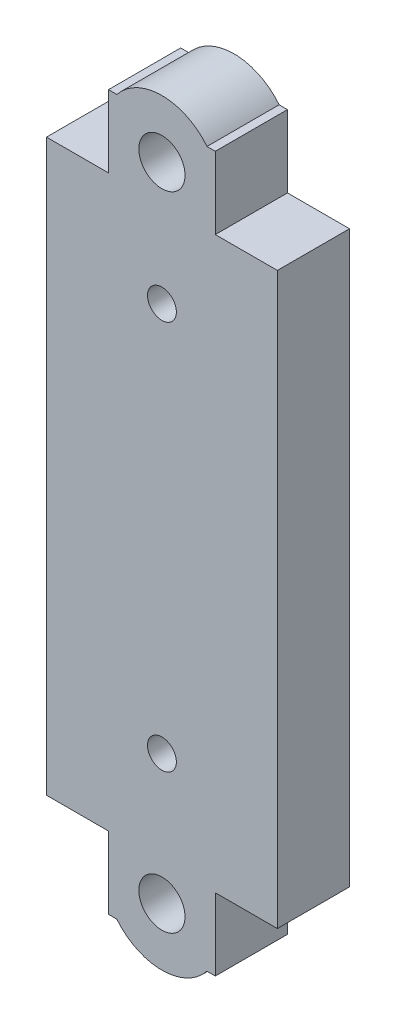
ISO-10303-21;
HEADER;
FILE_DESCRIPTION(('STEP AP214'),'2;1');
FILE_NAME('part.step','',(''),(''),'','','');
FILE_SCHEMA(('AUTOMOTIVE_DESIGN { 1 0 10303 214 1 1 1 1 }'));
ENDSEC;
DATA;
#1=APPLICATION_CONTEXT('core data for automotive mechanical design processes');
#2=APPLICATION_PROTOCOL_DEFINITION('international standard','automotive_design',2000,#1);
#3=PRODUCT_CONTEXT('',#1,'mechanical');
#4=PRODUCT('Part','Part','',(#3));
#5=PRODUCT_RELATED_PRODUCT_CATEGORY('part','',(#4));
#6=PRODUCT_DEFINITION_FORMATION('','',#4);
#7=PRODUCT_DEFINITION_CONTEXT('part definition',#1,'design');
#8=PRODUCT_DEFINITION('design','',#6,#7);
#9=PRODUCT_DEFINITION_SHAPE('','',#8);
#10=(LENGTH_UNIT() NAMED_UNIT(*) SI_UNIT(.MILLI.,.METRE.));
#11=(NAMED_UNIT(*) PLANE_ANGLE_UNIT() SI_UNIT($,.RADIAN.));
#12=(NAMED_UNIT(*) SI_UNIT($,.STERADIAN.) SOLID_ANGLE_UNIT());
#13=UNCERTAINTY_MEASURE_WITH_UNIT(LENGTH_MEASURE(1.E-05),#10,'distance_accuracy_value','');
#14=(GEOMETRIC_REPRESENTATION_CONTEXT(3) GLOBAL_UNCERTAINTY_ASSIGNED_CONTEXT((#13)) GLOBAL_UNIT_ASSIGNED_CONTEXT((#10,
#11,#12)) REPRESENTATION_CONTEXT('',''));
#15=CARTESIAN_POINT('',(0.,0.,0.));
#16=DIRECTION('',(0.,0.,1.));
#17=DIRECTION('',(1.,0.,0.));
#18=AXIS2_PLACEMENT_3D('',#15,#16,#17);
#19=CARTESIAN_POINT('',(1.01197788697789,11.6590909090909,-5.));
#20=DIRECTION('',(0.,1.,0.));
#21=DIRECTION('',(0.,0.,1.));
#22=AXIS2_PLACEMENT_3D('',#19,#20,#21);
#23=PLANE('',#22);
#24=DIRECTION('',(0.,0.,1.));
#25=VECTOR('',#24,1.);
#26=CARTESIAN_POINT('',(-10.6880221130236,11.6590909090909,-5.));
#27=LINE('',#26,#25);
#28=CARTESIAN_POINT('',(-10.6880221130236,11.6590909090909,0.));
#29=VERTEX_POINT('',#28);
#30=CARTESIAN_POINT('',(-10.6880221130236,11.6590909090909,5.));
#31=VERTEX_POINT('',#30);
#32=EDGE_CURVE('E166',#29,#31,#27,.T.);
#33=ORIENTED_EDGE('',*,*,#32,.T.);
#34=DIRECTION('',(-1.,0.,0.));
#35=VECTOR('',#34,1.);
#36=CARTESIAN_POINT('',(1.01197788697789,11.6590909090909,5.));
#37=LINE('',#36,#35);
#38=CARTESIAN_POINT('',(-10.1105211122259,11.6590909090909,5.));
#39=VERTEX_POINT('',#38);
#40=EDGE_CURVE('E171',#39,#31,#37,.T.);
#41=ORIENTED_EDGE('',*,*,#40,.F.);
#42=DIRECTION('',(0.,0.,1.));
#43=VECTOR('',#42,1.);
#44=CARTESIAN_POINT('',(-10.1105211122259,11.6590909090909,0.));
#45=LINE('',#44,#43);
#46=CARTESIAN_POINT('',(-10.1105211122259,11.6590909090909,0.));
#47=VERTEX_POINT('',#46);
#48=EDGE_CURVE('E211',#47,#39,#45,.T.);
#49=ORIENTED_EDGE('',*,*,#48,.F.);
#50=DIRECTION('',(-1.,0.,0.));
#51=VECTOR('',#50,1.);
#52=CARTESIAN_POINT('',(0.,11.6590909090909,0.));
#53=LINE('',#52,#51);
#54=EDGE_CURVE('E239',#47,#29,#53,.T.);
#55=ORIENTED_EDGE('',*,*,#54,.T.);
#56=EDGE_LOOP('',(#33,#41,#49,#55));
#57=FACE_BOUND('',#56,.T.);
#58=ADVANCED_FACE('F36',(#57),#23,.T.);
#59=CARTESIAN_POINT('',(1.01197788697789,-37.8409090909091,-5.));
#60=DIRECTION('',(0.,-1.,0.));
#61=DIRECTION('',(0.,0.,-1.));
#62=AXIS2_PLACEMENT_3D('',#59,#60,#61);
#63=PLANE('',#62);
#64=DIRECTION('',(0.,0.,1.));
#65=VECTOR('',#64,1.);
#66=CARTESIAN_POINT('',(-3.28802211302445,-37.84090909091,-5.));
#67=LINE('',#66,#65);
#68=CARTESIAN_POINT('',(-3.28802211302445,-37.84090909091,0.));
#69=VERTEX_POINT('',#68);
#70=CARTESIAN_POINT('',(-3.28802211302445,-37.84090909091,5.));
#71=VERTEX_POINT('',#70);
#72=EDGE_CURVE('E194',#69,#71,#67,.T.);
#73=ORIENTED_EDGE('',*,*,#72,.T.);
#74=DIRECTION('',(1.,0.,0.));
#75=VECTOR('',#74,1.);
#76=CARTESIAN_POINT('',(1.01197788697789,-37.8409090909091,5.));
#77=LINE('',#76,#75);
#78=CARTESIAN_POINT('',(-3.86552311382832,-37.8409090909091,5.));
#79=VERTEX_POINT('',#78);
#80=EDGE_CURVE('E236',#79,#71,#77,.T.);
#81=ORIENTED_EDGE('',*,*,#80,.F.);
#82=DIRECTION('',(0.,0.,1.));
#83=VECTOR('',#82,1.);
#84=CARTESIAN_POINT('',(-3.86552311382832,-37.8409090909091,0.));
#85=LINE('',#84,#83);
#86=CARTESIAN_POINT('',(-3.86552311382832,-37.8409090909091,0.));
#87=VERTEX_POINT('',#86);
#88=EDGE_CURVE('E219',#87,#79,#85,.T.);
#89=ORIENTED_EDGE('',*,*,#88,.F.);
#90=DIRECTION('',(1.,0.,0.));
#91=VECTOR('',#90,1.);
#92=CARTESIAN_POINT('',(0.,-37.8409090909091,0.));
#93=LINE('',#92,#91);
#94=EDGE_CURVE('E245',#87,#69,#93,.T.);
#95=ORIENTED_EDGE('',*,*,#94,.T.);
#96=EDGE_LOOP('',(#73,#81,#89,#95));
#97=FACE_BOUND('',#96,.T.);
#98=ADVANCED_FACE('F301',(#97),#63,.T.);
#99=CARTESIAN_POINT('',(0.,0.,5.));
#100=DIRECTION('',(0.,0.,1.));
#101=DIRECTION('',(1.,0.,0.));
#102=AXIS2_PLACEMENT_3D('',#99,#100,#101);
#103=PLANE('',#102);
#104=DIRECTION('',(-1.,0.,0.));
#105=VECTOR('',#104,1.);
#106=CARTESIAN_POINT('',(-9.98802211302211,-32.8409090909091,5.));
#107=LINE('',#106,#105);
#108=CARTESIAN_POINT('',(-10.6880221130244,-32.8409090909091,5.));
#109=VERTEX_POINT('',#108);
#110=CARTESIAN_POINT('',(-14.9880221130221,-32.8409090909091,5.));
#111=VERTEX_POINT('',#110);
#112=EDGE_CURVE('E254',#109,#111,#107,.T.);
#113=ORIENTED_EDGE('',*,*,#112,.F.);
#114=DIRECTION('',(0.,1.,0.));
#115=VECTOR('',#114,1.);
#116=CARTESIAN_POINT('',(-10.6880221130244,-37.84090909091,5.));
#117=LINE('',#116,#115);
#118=CARTESIAN_POINT('',(-10.6880221130244,-37.84090909091,5.));
#119=VERTEX_POINT('',#118);
#120=EDGE_CURVE('E176',#119,#109,#117,.T.);
#121=ORIENTED_EDGE('',*,*,#120,.F.);
#122=CARTESIAN_POINT('',(-10.1105211122275,-37.8409090909091,5.));
#123=VERTEX_POINT('',#122);
#124=EDGE_CURVE('E237',#119,#123,#77,.T.);
#125=ORIENTED_EDGE('',*,*,#124,.T.);
#126=CARTESIAN_POINT('',(-6.98802211302791,-35.3409090909095,5.));
#127=DIRECTION('',(0.,0.,1.));
#128=DIRECTION('',(1.,0.,0.));
#129=AXIS2_PLACEMENT_3D('',#126,#127,#128);
#130=CIRCLE('',#129,4.);
#131=EDGE_CURVE('E58',#123,#79,#130,.T.);
#132=ORIENTED_EDGE('',*,*,#131,.T.);
#133=ORIENTED_EDGE('',*,*,#80,.T.);
#134=DIRECTION('',(0.,-1.,0.));
#135=VECTOR('',#134,1.);
#136=CARTESIAN_POINT('',(-3.28802211302445,-37.84090909091,5.));
#137=LINE('',#136,#135);
#138=CARTESIAN_POINT('',(-3.28802211302445,-32.8409090909091,5.));
#139=VERTEX_POINT('',#138);
#140=EDGE_CURVE('E184',#139,#71,#137,.T.);
#141=ORIENTED_EDGE('',*,*,#140,.F.);
#142=DIRECTION('',(-1.,0.,0.));
#143=VECTOR('',#142,1.);
#144=CARTESIAN_POINT('',(-3.98802211302211,-32.8409090909091,5.));
#145=LINE('',#144,#143);
#146=CARTESIAN_POINT('',(1.01197788697789,-32.8409090909091,5.));
#147=VERTEX_POINT('',#146);
#148=EDGE_CURVE('E273',#147,#139,#145,.T.);
#149=ORIENTED_EDGE('',*,*,#148,.F.);
#150=DIRECTION('',(0.,1.,0.));
#151=VECTOR('',#150,1.);
#152=CARTESIAN_POINT('',(1.01197788697789,-37.8409090909091,5.));
#153=LINE('',#152,#151);
#154=CARTESIAN_POINT('',(1.01197788697789,6.65909090909093,5.));
#155=VERTEX_POINT('',#154);
#156=EDGE_CURVE('E228',#147,#155,#153,.T.);
#157=ORIENTED_EDGE('',*,*,#156,.T.);
#158=DIRECTION('',(1.,0.,0.));
#159=VECTOR('',#158,1.);
#160=CARTESIAN_POINT('',(-3.98802211302212,6.65909090909093,5.));
#161=LINE('',#160,#159);
#162=CARTESIAN_POINT('',(-3.28802211302355,6.65909090909093,5.));
#163=VERTEX_POINT('',#162);
#164=EDGE_CURVE('E279',#163,#155,#161,.T.);
#165=ORIENTED_EDGE('',*,*,#164,.F.);
#166=DIRECTION('',(0.,-1.,0.));
#167=VECTOR('',#166,1.);
#168=CARTESIAN_POINT('',(-3.28802211302355,6.65909090909093,5.));
#169=LINE('',#168,#167);
#170=CARTESIAN_POINT('',(-3.28802211302355,11.6590909090909,5.));
#171=VERTEX_POINT('',#170);
#172=EDGE_CURVE('E174',#171,#163,#169,.T.);
#173=ORIENTED_EDGE('',*,*,#172,.F.);
#174=CARTESIAN_POINT('',(-3.86552311382988,11.6590909090909,5.));
#175=VERTEX_POINT('',#174);
#176=EDGE_CURVE('E232',#171,#175,#37,.T.);
#177=ORIENTED_EDGE('',*,*,#176,.T.);
#178=CARTESIAN_POINT('',(-6.98802211302791,9.15909090909091,5.));
#179=DIRECTION('',(0.,0.,1.));
#180=DIRECTION('',(1.,0.,0.));
#181=AXIS2_PLACEMENT_3D('',#178,#179,#180);
#182=CIRCLE('',#181,3.9999999999991);
#183=EDGE_CURVE('E51',#175,#39,#182,.T.);
#184=ORIENTED_EDGE('',*,*,#183,.T.);
#185=ORIENTED_EDGE('',*,*,#40,.T.);
#186=DIRECTION('',(0.,1.,0.));
#187=VECTOR('',#186,1.);
#188=CARTESIAN_POINT('',(-10.6880221130236,11.6590909090909,5.));
#189=LINE('',#188,#187);
#190=CARTESIAN_POINT('',(-10.6880221130236,6.65909090909093,5.));
#191=VERTEX_POINT('',#190);
#192=EDGE_CURVE('E164',#191,#31,#189,.T.);
#193=ORIENTED_EDGE('',*,*,#192,.F.);
#194=DIRECTION('',(1.,0.,0.));
#195=VECTOR('',#194,1.);
#196=CARTESIAN_POINT('',(-9.98802211302212,6.65909090909093,5.));
#197=LINE('',#196,#195);
#198=CARTESIAN_POINT('',(-14.9880221130221,6.65909090909093,5.));
#199=VERTEX_POINT('',#198);
#200=EDGE_CURVE('E151',#199,#191,#197,.T.);
#201=ORIENTED_EDGE('',*,*,#200,.F.);
#202=DIRECTION('',(0.,-1.,0.));
#203=VECTOR('',#202,1.);
#204=CARTESIAN_POINT('',(-14.9880221130221,-37.8409090909091,5.));
#205=LINE('',#204,#203);
#206=EDGE_CURVE('E234',#199,#111,#205,.T.);
#207=ORIENTED_EDGE('',*,*,#206,.T.);
#208=EDGE_LOOP('',(#113,#121,#125,#132,#133,#141,#149,#157,#165,#173,#177,#184,#185,#193,#201,#207));
#209=FACE_BOUND('',#208,.T.);
#210=CARTESIAN_POINT('',(-6.98802211302791,-35.3409090909095,5.));
#211=DIRECTION('',(0.,0.,1.));
#212=DIRECTION('',(1.,0.,0.));
#213=AXIS2_PLACEMENT_3D('',#210,#211,#212);
#214=CIRCLE('',#213,1.6);
#215=CARTESIAN_POINT('',(-5.38802211302791,-35.3409090909095,5.));
#216=VERTEX_POINT('',#215);
#217=EDGE_CURVE('E222',#216,#216,#214,.T.);
#218=ORIENTED_EDGE('',*,*,#217,.F.);
#219=EDGE_LOOP('',(#218));
#220=FACE_BOUND('',#219,.T.);
#221=CARTESIAN_POINT('',(-6.98802211302211,-26.3409090909091,5.));
#222=DIRECTION('',(0.,0.,1.));
#223=DIRECTION('',(1.,0.,0.));
#224=AXIS2_PLACEMENT_3D('',#221,#222,#223);
#225=CIRCLE('',#224,1.);
#226=CARTESIAN_POINT('',(-5.98802211302211,-26.3409090909091,5.));
#227=VERTEX_POINT('',#226);
#228=EDGE_CURVE('E261',#227,#227,#225,.T.);
#229=ORIENTED_EDGE('',*,*,#228,.F.);
#230=EDGE_LOOP('',(#229));
#231=FACE_BOUND('',#230,.T.);
#232=CARTESIAN_POINT('',(-6.98802211302211,0.65909090909093,5.));
#233=DIRECTION('',(0.,0.,1.));
#234=DIRECTION('',(1.,0.,0.));
#235=AXIS2_PLACEMENT_3D('',#232,#233,#234);
#236=CIRCLE('',#235,1.);
#237=CARTESIAN_POINT('',(-5.98802211302211,0.65909090909093,5.));
#238=VERTEX_POINT('',#237);
#239=EDGE_CURVE('E267',#238,#238,#236,.T.);
#240=ORIENTED_EDGE('',*,*,#239,.F.);
#241=EDGE_LOOP('',(#240));
#242=FACE_BOUND('',#241,.T.);
#243=CARTESIAN_POINT('',(-6.98802211302791,9.15909090909091,5.));
#244=DIRECTION('',(0.,0.,1.));
#245=DIRECTION('',(1.,0.,0.));
#246=AXIS2_PLACEMENT_3D('',#243,#244,#245);
#247=CIRCLE('',#246,1.6);
#248=CARTESIAN_POINT('',(-5.38802211302791,9.15909090909091,5.));
#249=VERTEX_POINT('',#248);
#250=EDGE_CURVE('E221',#249,#249,#247,.T.);
#251=ORIENTED_EDGE('',*,*,#250,.F.);
#252=EDGE_LOOP('',(#251));
#253=FACE_BOUND('',#252,.T.);
#254=ADVANCED_FACE('F168',(#209,#220,#231,#242,#253),#103,.T.);
#255=CARTESIAN_POINT('',(0.,0.,0.));
#256=DIRECTION('',(0.,0.,1.));
#257=DIRECTION('',(1.,0.,0.));
#258=AXIS2_PLACEMENT_3D('',#255,#256,#257);
#259=PLANE('',#258);
#260=DIRECTION('',(0.,1.,0.));
#261=VECTOR('',#260,1.);
#262=CARTESIAN_POINT('',(-10.6880221130244,0.,0.));
#263=LINE('',#262,#261);
#264=CARTESIAN_POINT('',(-10.6880221130244,-37.84090909091,0.));
#265=VERTEX_POINT('',#264);
#266=CARTESIAN_POINT('',(-10.6880221130244,-32.8409090909091,0.));
#267=VERTEX_POINT('',#266);
#268=EDGE_CURVE('E197',#265,#267,#263,.T.);
#269=ORIENTED_EDGE('',*,*,#268,.T.);
#270=DIRECTION('',(-1.,0.,0.));
#271=VECTOR('',#270,1.);
#272=CARTESIAN_POINT('',(-9.98802211302211,-32.8409090909091,0.));
#273=LINE('',#272,#271);
#274=CARTESIAN_POINT('',(-14.9880221130221,-32.8409090909091,0.));
#275=VERTEX_POINT('',#274);
#276=EDGE_CURVE('E253',#267,#275,#273,.T.);
#277=ORIENTED_EDGE('',*,*,#276,.T.);
#278=DIRECTION('',(0.,-1.,0.));
#279=VECTOR('',#278,1.);
#280=CARTESIAN_POINT('',(-14.9880221130221,0.,0.));
#281=LINE('',#280,#279);
#282=CARTESIAN_POINT('',(-14.9880221130221,6.65909090909093,0.));
#283=VERTEX_POINT('',#282);
#284=EDGE_CURVE('E242',#283,#275,#281,.T.);
#285=ORIENTED_EDGE('',*,*,#284,.F.);
#286=DIRECTION('',(1.,0.,0.));
#287=VECTOR('',#286,1.);
#288=CARTESIAN_POINT('',(-9.98802211302212,6.65909090909093,0.));
#289=LINE('',#288,#287);
#290=CARTESIAN_POINT('',(-10.6880221130236,6.65909090909093,0.));
#291=VERTEX_POINT('',#290);
#292=EDGE_CURVE('E159',#283,#291,#289,.T.);
#293=ORIENTED_EDGE('',*,*,#292,.T.);
#294=DIRECTION('',(0.,1.,0.));
#295=VECTOR('',#294,1.);
#296=CARTESIAN_POINT('',(-10.6880221130235,0.,0.));
#297=LINE('',#296,#295);
#298=EDGE_CURVE('E11',#291,#29,#297,.T.);
#299=ORIENTED_EDGE('',*,*,#298,.T.);
#300=ORIENTED_EDGE('',*,*,#54,.F.);
#301=CARTESIAN_POINT('',(-6.98802211302791,9.15909090909091,0.));
#302=DIRECTION('',(0.,0.,1.));
#303=DIRECTION('',(1.,0.,0.));
#304=AXIS2_PLACEMENT_3D('',#301,#302,#303);
#305=CIRCLE('',#304,3.9999999999991);
#306=CARTESIAN_POINT('',(-3.86552311382988,11.6590909090909,0.));
#307=VERTEX_POINT('',#306);
#308=EDGE_CURVE('E205',#307,#47,#305,.T.);
#309=ORIENTED_EDGE('',*,*,#308,.F.);
#310=CARTESIAN_POINT('',(-3.28802211302355,11.6590909090909,0.));
#311=VERTEX_POINT('',#310);
#312=EDGE_CURVE('E240',#311,#307,#53,.T.);
#313=ORIENTED_EDGE('',*,*,#312,.F.);
#314=DIRECTION('',(0.,-1.,0.));
#315=VECTOR('',#314,1.);
#316=CARTESIAN_POINT('',(-3.28802211302355,0.,0.));
#317=LINE('',#316,#315);
#318=CARTESIAN_POINT('',(-3.28802211302355,6.65909090909093,0.));
#319=VERTEX_POINT('',#318);
#320=EDGE_CURVE('E202',#311,#319,#317,.T.);
#321=ORIENTED_EDGE('',*,*,#320,.T.);
#322=DIRECTION('',(1.,0.,0.));
#323=VECTOR('',#322,1.);
#324=CARTESIAN_POINT('',(-3.98802211302212,6.65909090909093,0.));
#325=LINE('',#324,#323);
#326=CARTESIAN_POINT('',(1.01197788697789,6.65909090909093,0.));
#327=VERTEX_POINT('',#326);
#328=EDGE_CURVE('E278',#319,#327,#325,.T.);
#329=ORIENTED_EDGE('',*,*,#328,.T.);
#330=DIRECTION('',(0.,1.,0.));
#331=VECTOR('',#330,1.);
#332=CARTESIAN_POINT('',(1.01197788697789,0.,0.));
#333=LINE('',#332,#331);
#334=CARTESIAN_POINT('',(1.01197788697789,-32.8409090909091,0.));
#335=VERTEX_POINT('',#334);
#336=EDGE_CURVE('E248',#335,#327,#333,.T.);
#337=ORIENTED_EDGE('',*,*,#336,.F.);
#338=DIRECTION('',(-1.,0.,0.));
#339=VECTOR('',#338,1.);
#340=CARTESIAN_POINT('',(-3.98802211302211,-32.8409090909091,0.));
#341=LINE('',#340,#339);
#342=CARTESIAN_POINT('',(-3.28802211302445,-32.8409090909091,0.));
#343=VERTEX_POINT('',#342);
#344=EDGE_CURVE('E270',#335,#343,#341,.T.);
#345=ORIENTED_EDGE('',*,*,#344,.T.);
#346=DIRECTION('',(0.,-1.,0.));
#347=VECTOR('',#346,1.);
#348=CARTESIAN_POINT('',(-3.28802211302445,0.,0.));
#349=LINE('',#348,#347);
#350=EDGE_CURVE('E44',#343,#69,#349,.T.);
#351=ORIENTED_EDGE('',*,*,#350,.T.);
#352=ORIENTED_EDGE('',*,*,#94,.F.);
#353=CARTESIAN_POINT('',(-6.98802211302791,-35.3409090909095,0.));
#354=DIRECTION('',(0.,0.,1.));
#355=DIRECTION('',(1.,0.,0.));
#356=AXIS2_PLACEMENT_3D('',#353,#354,#355);
#357=CIRCLE('',#356,4.);
#358=CARTESIAN_POINT('',(-10.1105211122275,-37.8409090909091,0.));
#359=VERTEX_POINT('',#358);
#360=EDGE_CURVE('E213',#359,#87,#357,.T.);
#361=ORIENTED_EDGE('',*,*,#360,.F.);
#362=EDGE_CURVE('E246',#265,#359,#93,.T.);
#363=ORIENTED_EDGE('',*,*,#362,.F.);
#364=EDGE_LOOP('',(#269,#277,#285,#293,#299,#300,#309,#313,#321,#329,#337,#345,#351,#352,#361,#363));
#365=FACE_BOUND('',#364,.T.);
#366=CARTESIAN_POINT('',(-6.98802211302791,-35.3409090909095,0.));
#367=DIRECTION('',(0.,0.,1.));
#368=DIRECTION('',(1.,0.,0.));
#369=AXIS2_PLACEMENT_3D('',#366,#367,#368);
#370=CIRCLE('',#369,1.6);
#371=CARTESIAN_POINT('',(-5.38802211302791,-35.3409090909095,0.));
#372=VERTEX_POINT('',#371);
#373=EDGE_CURVE('E231',#372,#372,#370,.T.);
#374=ORIENTED_EDGE('',*,*,#373,.T.);
#375=EDGE_LOOP('',(#374));
#376=FACE_BOUND('',#375,.T.);
#377=CARTESIAN_POINT('',(-6.98802211302211,0.65909090909093,0.));
#378=DIRECTION('',(0.,0.,1.));
#379=DIRECTION('',(1.,0.,0.));
#380=AXIS2_PLACEMENT_3D('',#377,#378,#379);
#381=CIRCLE('',#380,1.);
#382=CARTESIAN_POINT('',(-5.98802211302211,0.65909090909093,0.));
#383=VERTEX_POINT('',#382);
#384=EDGE_CURVE('E264',#383,#383,#381,.T.);
#385=ORIENTED_EDGE('',*,*,#384,.T.);
#386=EDGE_LOOP('',(#385));
#387=FACE_BOUND('',#386,.T.);
#388=CARTESIAN_POINT('',(-6.98802211302211,-26.3409090909091,0.));
#389=DIRECTION('',(0.,0.,1.));
#390=DIRECTION('',(1.,0.,0.));
#391=AXIS2_PLACEMENT_3D('',#388,#389,#390);
#392=CIRCLE('',#391,1.);
#393=CARTESIAN_POINT('',(-5.98802211302211,-26.3409090909091,0.));
#394=VERTEX_POINT('',#393);
#395=EDGE_CURVE('E260',#394,#394,#392,.T.);
#396=ORIENTED_EDGE('',*,*,#395,.T.);
#397=EDGE_LOOP('',(#396));
#398=FACE_BOUND('',#397,.T.);
#399=CARTESIAN_POINT('',(-6.98802211302791,9.15909090909091,0.));
#400=DIRECTION('',(0.,0.,1.));
#401=DIRECTION('',(1.,0.,0.));
#402=AXIS2_PLACEMENT_3D('',#399,#400,#401);
#403=CIRCLE('',#402,1.6);
#404=CARTESIAN_POINT('',(-5.38802211302791,9.15909090909091,0.));
#405=VERTEX_POINT('',#404);
#406=EDGE_CURVE('E225',#405,#405,#403,.T.);
#407=ORIENTED_EDGE('',*,*,#406,.T.);
#408=EDGE_LOOP('',(#407));
#409=FACE_BOUND('',#408,.T.);
#410=ADVANCED_FACE('F38',(#365,#376,#387,#398,#409),#259,.F.);
#411=CARTESIAN_POINT('',(-3.98802211302212,6.65909090909093,5.));
#412=DIRECTION('',(0.,1.,0.));
#413=DIRECTION('',(0.,0.,1.));
#414=AXIS2_PLACEMENT_3D('',#411,#412,#413);
#415=PLANE('',#414);
#416=ORIENTED_EDGE('',*,*,#328,.F.);
#417=DIRECTION('',(0.,0.,1.));
#418=VECTOR('',#417,1.);
#419=CARTESIAN_POINT('',(-3.28802211302355,6.65909090909093,-5.));
#420=LINE('',#419,#418);
#421=EDGE_CURVE('E180',#319,#163,#420,.T.);
#422=ORIENTED_EDGE('',*,*,#421,.T.);
#423=ORIENTED_EDGE('',*,*,#164,.T.);
#424=DIRECTION('',(0.,0.,-1.));
#425=VECTOR('',#424,1.);
#426=CARTESIAN_POINT('',(1.01197788697789,6.65909090909093,5.));
#427=LINE('',#426,#425);
#428=EDGE_CURVE('E281',#155,#327,#427,.T.);
#429=ORIENTED_EDGE('',*,*,#428,.T.);
#430=EDGE_LOOP('',(#416,#422,#423,#429));
#431=FACE_BOUND('',#430,.T.);
#432=ADVANCED_FACE('F357',(#431),#415,.T.);
#433=CARTESIAN_POINT('',(-3.98802211302211,-32.8409090909091,5.));
#434=DIRECTION('',(0.,-1.,0.));
#435=DIRECTION('',(0.,0.,-1.));
#436=AXIS2_PLACEMENT_3D('',#433,#434,#435);
#437=PLANE('',#436);
#438=ORIENTED_EDGE('',*,*,#148,.T.);
#439=DIRECTION('',(0.,0.,1.));
#440=VECTOR('',#439,1.);
#441=CARTESIAN_POINT('',(-3.28802211302445,-32.8409090909091,-5.));
#442=LINE('',#441,#440);
#443=EDGE_CURVE('E193',#343,#139,#442,.T.);
#444=ORIENTED_EDGE('',*,*,#443,.F.);
#445=ORIENTED_EDGE('',*,*,#344,.F.);
#446=DIRECTION('',(0.,0.,-1.));
#447=VECTOR('',#446,1.);
#448=CARTESIAN_POINT('',(1.01197788697789,-32.8409090909091,5.));
#449=LINE('',#448,#447);
#450=EDGE_CURVE('E275',#147,#335,#449,.T.);
#451=ORIENTED_EDGE('',*,*,#450,.F.);
#452=EDGE_LOOP('',(#438,#444,#445,#451));
#453=FACE_BOUND('',#452,.T.);
#454=ADVANCED_FACE('F353',(#453),#437,.T.);
#455=CARTESIAN_POINT('',(-6.98802211302211,0.65909090909093,5.));
#456=DIRECTION('',(0.,0.,-1.));
#457=DIRECTION('',(-1.,0.,0.));
#458=AXIS2_PLACEMENT_3D('',#455,#456,#457);
#459=CYLINDRICAL_SURFACE('',#458,1.);
#460=ORIENTED_EDGE('',*,*,#239,.T.);
#461=EDGE_LOOP('',(#460));
#462=FACE_BOUND('',#461,.T.);
#463=ORIENTED_EDGE('',*,*,#384,.F.);
#464=EDGE_LOOP('',(#463));
#465=FACE_BOUND('',#464,.T.);
#466=ADVANCED_FACE('F349',(#462,#465),#459,.F.);
#467=CARTESIAN_POINT('',(-6.98802211302211,-26.3409090909091,5.));
#468=DIRECTION('',(0.,0.,-1.));
#469=DIRECTION('',(-1.,0.,0.));
#470=AXIS2_PLACEMENT_3D('',#467,#468,#469);
#471=CYLINDRICAL_SURFACE('',#470,1.);
#472=ORIENTED_EDGE('',*,*,#228,.T.);
#473=EDGE_LOOP('',(#472));
#474=FACE_BOUND('',#473,.T.);
#475=ORIENTED_EDGE('',*,*,#395,.F.);
#476=EDGE_LOOP('',(#475));
#477=FACE_BOUND('',#476,.T.);
#478=ADVANCED_FACE('F346',(#474,#477),#471,.F.);
#479=CARTESIAN_POINT('',(-9.98802211302211,-32.8409090909091,5.));
#480=DIRECTION('',(0.,-1.,0.));
#481=DIRECTION('',(0.,0.,-1.));
#482=AXIS2_PLACEMENT_3D('',#479,#480,#481);
#483=PLANE('',#482);
#484=ORIENTED_EDGE('',*,*,#276,.F.);
#485=DIRECTION('',(0.,0.,1.));
#486=VECTOR('',#485,1.);
#487=CARTESIAN_POINT('',(-10.6880221130244,-32.8409090909091,-5.));
#488=LINE('',#487,#486);
#489=EDGE_CURVE('E181',#267,#109,#488,.T.);
#490=ORIENTED_EDGE('',*,*,#489,.T.);
#491=ORIENTED_EDGE('',*,*,#112,.T.);
#492=DIRECTION('',(0.,0.,-1.));
#493=VECTOR('',#492,1.);
#494=CARTESIAN_POINT('',(-14.9880221130221,-32.8409090909091,5.));
#495=LINE('',#494,#493);
#496=EDGE_CURVE('E256',#111,#275,#495,.T.);
#497=ORIENTED_EDGE('',*,*,#496,.T.);
#498=EDGE_LOOP('',(#484,#490,#491,#497));
#499=FACE_BOUND('',#498,.T.);
#500=ADVANCED_FACE('F317',(#499),#483,.T.);
#501=CARTESIAN_POINT('',(-9.98802211302212,6.65909090909093,5.));
#502=DIRECTION('',(0.,1.,0.));
#503=DIRECTION('',(-1.,0.,0.));
#504=AXIS2_PLACEMENT_3D('',#501,#502,#503);
#505=PLANE('',#504);
#506=ORIENTED_EDGE('',*,*,#200,.T.);
#507=DIRECTION('',(0.,0.,1.));
#508=VECTOR('',#507,1.);
#509=CARTESIAN_POINT('',(-10.6880221130236,6.65909090909093,-5.));
#510=LINE('',#509,#508);
#511=EDGE_CURVE('E155',#291,#191,#510,.T.);
#512=ORIENTED_EDGE('',*,*,#511,.F.);
#513=ORIENTED_EDGE('',*,*,#292,.F.);
#514=DIRECTION('',(0.,0.,-1.));
#515=VECTOR('',#514,1.);
#516=CARTESIAN_POINT('',(-14.9880221130221,6.65909090909093,5.));
#517=LINE('',#516,#515);
#518=EDGE_CURVE('E156',#199,#283,#517,.T.);
#519=ORIENTED_EDGE('',*,*,#518,.F.);
#520=EDGE_LOOP('',(#506,#512,#513,#519));
#521=FACE_BOUND('',#520,.T.);
#522=ADVANCED_FACE('F153',(#521),#505,.T.);
#523=DIRECTION('',(0.,0.,1.));
#524=VECTOR('',#523,1.);
#525=CARTESIAN_POINT('',(-3.28802211302355,11.6590909090909,-5.));
#526=LINE('',#525,#524);
#527=EDGE_CURVE('E188',#311,#171,#526,.T.);
#528=ORIENTED_EDGE('',*,*,#527,.F.);
#529=ORIENTED_EDGE('',*,*,#312,.T.);
#530=DIRECTION('',(0.,0.,1.));
#531=VECTOR('',#530,1.);
#532=CARTESIAN_POINT('',(-3.86552311382988,11.6590909090909,0.));
#533=LINE('',#532,#531);
#534=EDGE_CURVE('E207',#175,#307,#533,.F.);
#535=ORIENTED_EDGE('',*,*,#534,.F.);
#536=ORIENTED_EDGE('',*,*,#176,.F.);
#537=EDGE_LOOP('',(#528,#529,#535,#536));
#538=FACE_BOUND('',#537,.T.);
#539=ADVANCED_FACE('F322',(#538),#23,.T.);
#540=CARTESIAN_POINT('',(-14.9880221130221,-37.8409090909091,-5.));
#541=DIRECTION('',(-1.,0.,0.));
#542=DIRECTION('',(0.,0.,1.));
#543=AXIS2_PLACEMENT_3D('',#540,#541,#542);
#544=PLANE('',#543);
#545=ORIENTED_EDGE('',*,*,#206,.F.);
#546=ORIENTED_EDGE('',*,*,#518,.T.);
#547=ORIENTED_EDGE('',*,*,#284,.T.);
#548=ORIENTED_EDGE('',*,*,#496,.F.);
#549=EDGE_LOOP('',(#545,#546,#547,#548));
#550=FACE_BOUND('',#549,.T.);
#551=ADVANCED_FACE('F320',(#550),#544,.T.);
#552=DIRECTION('',(0.,0.,1.));
#553=VECTOR('',#552,1.);
#554=CARTESIAN_POINT('',(-10.6880221130244,-37.84090909091,-5.));
#555=LINE('',#554,#553);
#556=EDGE_CURVE('E179',#265,#119,#555,.T.);
#557=ORIENTED_EDGE('',*,*,#556,.F.);
#558=ORIENTED_EDGE('',*,*,#362,.T.);
#559=DIRECTION('',(0.,0.,1.));
#560=VECTOR('',#559,1.);
#561=CARTESIAN_POINT('',(-10.1105211122275,-37.8409090909091,0.));
#562=LINE('',#561,#560);
#563=EDGE_CURVE('E215',#123,#359,#562,.F.);
#564=ORIENTED_EDGE('',*,*,#563,.F.);
#565=ORIENTED_EDGE('',*,*,#124,.F.);
#566=EDGE_LOOP('',(#557,#558,#564,#565));
#567=FACE_BOUND('',#566,.T.);
#568=ADVANCED_FACE('F309',(#567),#63,.T.);
#569=CARTESIAN_POINT('',(1.01197788697789,-37.8409090909091,-5.));
#570=DIRECTION('',(1.,0.,0.));
#571=DIRECTION('',(0.,0.,-1.));
#572=AXIS2_PLACEMENT_3D('',#569,#570,#571);
#573=PLANE('',#572);
#574=ORIENTED_EDGE('',*,*,#156,.F.);
#575=ORIENTED_EDGE('',*,*,#450,.T.);
#576=ORIENTED_EDGE('',*,*,#336,.T.);
#577=ORIENTED_EDGE('',*,*,#428,.F.);
#578=EDGE_LOOP('',(#574,#575,#576,#577));
#579=FACE_BOUND('',#578,.T.);
#580=ADVANCED_FACE('F328',(#579),#573,.T.);
#581=CARTESIAN_POINT('',(-6.98802211302791,9.15909090909091,-5.));
#582=DIRECTION('',(0.,0.,1.));
#583=DIRECTION('',(1.,0.,0.));
#584=AXIS2_PLACEMENT_3D('',#581,#582,#583);
#585=CYLINDRICAL_SURFACE('',#584,1.6);
#586=ORIENTED_EDGE('',*,*,#250,.T.);
#587=EDGE_LOOP('',(#586));
#588=FACE_BOUND('',#587,.T.);
#589=ORIENTED_EDGE('',*,*,#406,.F.);
#590=EDGE_LOOP('',(#589));
#591=FACE_BOUND('',#590,.T.);
#592=ADVANCED_FACE('F340',(#588,#591),#585,.F.);
#593=CARTESIAN_POINT('',(-6.98802211302791,-35.3409090909095,-5.));
#594=DIRECTION('',(0.,0.,1.));
#595=DIRECTION('',(1.,0.,0.));
#596=AXIS2_PLACEMENT_3D('',#593,#594,#595);
#597=CYLINDRICAL_SURFACE('',#596,1.6);
#598=ORIENTED_EDGE('',*,*,#217,.T.);
#599=EDGE_LOOP('',(#598));
#600=FACE_BOUND('',#599,.T.);
#601=ORIENTED_EDGE('',*,*,#373,.F.);
#602=EDGE_LOOP('',(#601));
#603=FACE_BOUND('',#602,.T.);
#604=ADVANCED_FACE('F450',(#600,#603),#597,.F.);
#605=CARTESIAN_POINT('',(-6.98802211302791,-35.3409090909095,0.));
#606=DIRECTION('',(0.,0.,1.));
#607=DIRECTION('',(1.,0.,0.));
#608=AXIS2_PLACEMENT_3D('',#605,#606,#607);
#609=CYLINDRICAL_SURFACE('',#608,4.);
#610=ORIENTED_EDGE('',*,*,#360,.T.);
#611=ORIENTED_EDGE('',*,*,#88,.T.);
#612=ORIENTED_EDGE('',*,*,#131,.F.);
#613=ORIENTED_EDGE('',*,*,#563,.T.);
#614=EDGE_LOOP('',(#610,#611,#612,#613));
#615=FACE_BOUND('',#614,.T.);
#616=ADVANCED_FACE('F304',(#615),#609,.T.);
#617=CARTESIAN_POINT('',(-6.98802211302791,9.15909090909091,0.));
#618=DIRECTION('',(0.,0.,1.));
#619=DIRECTION('',(1.,0.,0.));
#620=AXIS2_PLACEMENT_3D('',#617,#618,#619);
#621=CYLINDRICAL_SURFACE('',#620,3.9999999999991);
#622=ORIENTED_EDGE('',*,*,#308,.T.);
#623=ORIENTED_EDGE('',*,*,#48,.T.);
#624=ORIENTED_EDGE('',*,*,#183,.F.);
#625=ORIENTED_EDGE('',*,*,#534,.T.);
#626=EDGE_LOOP('',(#622,#623,#624,#625));
#627=FACE_BOUND('',#626,.T.);
#628=ADVANCED_FACE('F414',(#627),#621,.T.);
#629=CARTESIAN_POINT('',(-10.6880221130236,11.6590909090909,-5.));
#630=DIRECTION('',(1.,0.,0.));
#631=DIRECTION('',(0.,1.,0.));
#632=AXIS2_PLACEMENT_3D('',#629,#630,#631);
#633=PLANE('',#632);
#634=ORIENTED_EDGE('',*,*,#511,.T.);
#635=ORIENTED_EDGE('',*,*,#192,.T.);
#636=ORIENTED_EDGE('',*,*,#32,.F.);
#637=ORIENTED_EDGE('',*,*,#298,.F.);
#638=EDGE_LOOP('',(#634,#635,#636,#637));
#639=FACE_BOUND('',#638,.T.);
#640=ADVANCED_FACE('F163',(#639),#633,.F.);
#641=CARTESIAN_POINT('',(-3.28802211302355,6.65909090909093,-5.));
#642=DIRECTION('',(-1.,0.,0.));
#643=DIRECTION('',(0.,0.,1.));
#644=AXIS2_PLACEMENT_3D('',#641,#642,#643);
#645=PLANE('',#644);
#646=ORIENTED_EDGE('',*,*,#527,.T.);
#647=ORIENTED_EDGE('',*,*,#172,.T.);
#648=ORIENTED_EDGE('',*,*,#421,.F.);
#649=ORIENTED_EDGE('',*,*,#320,.F.);
#650=EDGE_LOOP('',(#646,#647,#648,#649));
#651=FACE_BOUND('',#650,.T.);
#652=ADVANCED_FACE('F413',(#651),#645,.F.);
#653=CARTESIAN_POINT('',(-10.6880221130244,-37.84090909091,-5.));
#654=DIRECTION('',(1.,0.,0.));
#655=DIRECTION('',(0.,0.,-1.));
#656=AXIS2_PLACEMENT_3D('',#653,#654,#655);
#657=PLANE('',#656);
#658=ORIENTED_EDGE('',*,*,#556,.T.);
#659=ORIENTED_EDGE('',*,*,#120,.T.);
#660=ORIENTED_EDGE('',*,*,#489,.F.);
#661=ORIENTED_EDGE('',*,*,#268,.F.);
#662=EDGE_LOOP('',(#658,#659,#660,#661));
#663=FACE_BOUND('',#662,.T.);
#664=ADVANCED_FACE('F313',(#663),#657,.F.);
#665=CARTESIAN_POINT('',(-3.28802211302445,-37.84090909091,-5.));
#666=DIRECTION('',(-1.,0.,0.));
#667=DIRECTION('',(0.,0.,1.));
#668=AXIS2_PLACEMENT_3D('',#665,#666,#667);
#669=PLANE('',#668);
#670=ORIENTED_EDGE('',*,*,#443,.T.);
#671=ORIENTED_EDGE('',*,*,#140,.T.);
#672=ORIENTED_EDGE('',*,*,#72,.F.);
#673=ORIENTED_EDGE('',*,*,#350,.F.);
#674=EDGE_LOOP('',(#670,#671,#672,#673));
#675=FACE_BOUND('',#674,.T.);
#676=ADVANCED_FACE('F433',(#675),#669,.F.);
#677=CLOSED_SHELL('',(#58,#98,#254,#410,#432,#454,#466,#478,#500,#522,#539,#551,#568,#580,#592,
#604,#616,#628,#640,#652,#664,#676));
#678=MANIFOLD_SOLID_BREP('B2',#677);
#679=ADVANCED_BREP_SHAPE_REPRESENTATION('',(#18,#678),#14);
#680=SHAPE_DEFINITION_REPRESENTATION(#9,#679);
ENDSEC;
END-ISO-10303-21;
